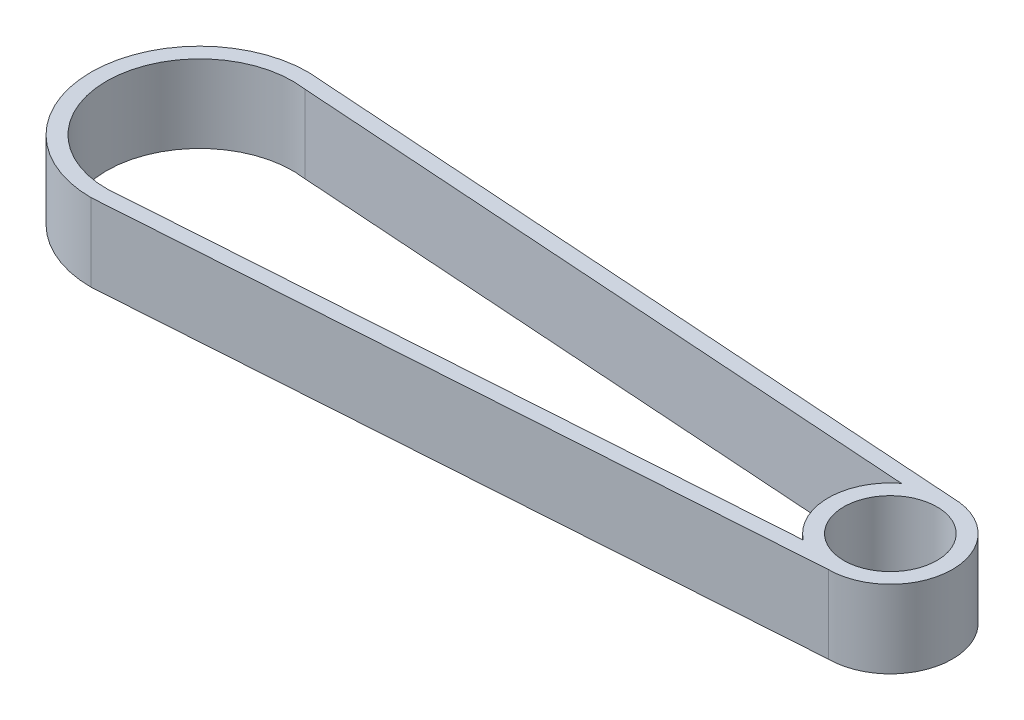
ISO-10303-21;
HEADER;
FILE_DESCRIPTION(('STEP AP214'),'2;1');
FILE_NAME('part.step','',(''),(''),'','','');
FILE_SCHEMA(('AUTOMOTIVE_DESIGN { 1 0 10303 214 1 1 1 1 }'));
ENDSEC;
DATA;
#1=APPLICATION_CONTEXT('core data for automotive mechanical design processes');
#2=APPLICATION_PROTOCOL_DEFINITION('international standard','automotive_design',2000,#1);
#3=PRODUCT_CONTEXT('',#1,'mechanical');
#4=PRODUCT('Part','Part','',(#3));
#5=PRODUCT_RELATED_PRODUCT_CATEGORY('part','',(#4));
#6=PRODUCT_DEFINITION_FORMATION('','',#4);
#7=PRODUCT_DEFINITION_CONTEXT('part definition',#1,'design');
#8=PRODUCT_DEFINITION('design','',#6,#7);
#9=PRODUCT_DEFINITION_SHAPE('','',#8);
#10=(LENGTH_UNIT() NAMED_UNIT(*) SI_UNIT(.MILLI.,.METRE.));
#11=(NAMED_UNIT(*) PLANE_ANGLE_UNIT() SI_UNIT($,.RADIAN.));
#12=(NAMED_UNIT(*) SI_UNIT($,.STERADIAN.) SOLID_ANGLE_UNIT());
#13=UNCERTAINTY_MEASURE_WITH_UNIT(LENGTH_MEASURE(1.E-05),#10,'distance_accuracy_value','');
#14=(GEOMETRIC_REPRESENTATION_CONTEXT(3) GLOBAL_UNCERTAINTY_ASSIGNED_CONTEXT((#13)) GLOBAL_UNIT_ASSIGNED_CONTEXT((#10,
#11,#12)) REPRESENTATION_CONTEXT('',''));
#15=CARTESIAN_POINT('',(0.,0.,0.));
#16=DIRECTION('',(0.,0.,1.));
#17=DIRECTION('',(1.,0.,0.));
#18=AXIS2_PLACEMENT_3D('',#15,#16,#17);
#19=CARTESIAN_POINT('',(0.,10.,0.));
#20=DIRECTION('',(0.,-1.,0.));
#21=DIRECTION('',(0.,0.,-1.));
#22=AXIS2_PLACEMENT_3D('',#19,#20,#21);
#23=CYLINDRICAL_SURFACE('',#22,14.);
#24=CARTESIAN_POINT('',(0.,0.,0.));
#25=DIRECTION('',(0.,1.,0.));
#26=DIRECTION('',(0.,0.,1.));
#27=AXIS2_PLACEMENT_3D('',#24,#25,#26);
#28=CIRCLE('',#27,14.);
#29=CARTESIAN_POINT('',(0.,0.,-14.));
#30=VERTEX_POINT('',#29);
#31=CARTESIAN_POINT('',(0.,0.,14.));
#32=VERTEX_POINT('',#31);
#33=EDGE_CURVE('E151',#30,#32,#28,.T.);
#34=ORIENTED_EDGE('',*,*,#33,.T.);
#35=DIRECTION('',(0.,-1.,0.));
#36=VECTOR('',#35,1.);
#37=CARTESIAN_POINT('',(0.,10.,14.));
#38=LINE('',#37,#36);
#39=CARTESIAN_POINT('',(0.,10.,14.));
#40=VERTEX_POINT('',#39);
#41=EDGE_CURVE('E11',#40,#32,#38,.T.);
#42=ORIENTED_EDGE('',*,*,#41,.F.);
#43=CARTESIAN_POINT('',(0.,10.,0.));
#44=DIRECTION('',(0.,1.,0.));
#45=DIRECTION('',(0.,0.,1.));
#46=AXIS2_PLACEMENT_3D('',#43,#44,#45);
#47=CIRCLE('',#46,14.);
#48=CARTESIAN_POINT('',(0.,10.,-14.));
#49=VERTEX_POINT('',#48);
#50=EDGE_CURVE('E119',#49,#40,#47,.T.);
#51=ORIENTED_EDGE('',*,*,#50,.F.);
#52=DIRECTION('',(0.,-1.,0.));
#53=VECTOR('',#52,1.);
#54=CARTESIAN_POINT('',(0.,10.,-14.));
#55=LINE('',#54,#53);
#56=EDGE_CURVE('E58',#49,#30,#55,.T.);
#57=ORIENTED_EDGE('',*,*,#56,.T.);
#58=EDGE_LOOP('',(#34,#42,#51,#57));
#59=FACE_BOUND('',#58,.T.);
#60=ADVANCED_FACE('F39',(#59),#23,.T.);
#61=CARTESIAN_POINT('',(0.939550081689078,10.,13.9366595450547));
#62=DIRECTION('',(-0.067263052342135,0.,-0.997735276408336));
#63=DIRECTION('',(-0.997735276408336,0.,0.067263052342135));
#64=AXIS2_PLACEMENT_3D('',#61,#62,#63);
#65=PLANE('',#64);
#66=DIRECTION('',(0.997735276408336,0.,-0.067263052342135));
#67=VECTOR('',#66,1.);
#68=CARTESIAN_POINT('',(0.939550081689078,0.,13.9366595450547));
#69=LINE('',#68,#67);
#70=CARTESIAN_POINT('',(89.,0.,8.));
#71=VERTEX_POINT('',#70);
#72=EDGE_CURVE('E125',#32,#71,#69,.T.);
#73=ORIENTED_EDGE('',*,*,#72,.T.);
#74=DIRECTION('',(0.,-1.,0.));
#75=VECTOR('',#74,1.);
#76=CARTESIAN_POINT('',(89.,10.,8.));
#77=LINE('',#76,#75);
#78=CARTESIAN_POINT('',(89.,10.,8.));
#79=VERTEX_POINT('',#78);
#80=EDGE_CURVE('E49',#79,#71,#77,.T.);
#81=ORIENTED_EDGE('',*,*,#80,.F.);
#82=DIRECTION('',(0.997735276408336,0.,-0.067263052342135));
#83=VECTOR('',#82,1.);
#84=CARTESIAN_POINT('',(0.939550081689078,10.,13.9366595450547));
#85=LINE('',#84,#83);
#86=EDGE_CURVE('E113',#40,#79,#85,.T.);
#87=ORIENTED_EDGE('',*,*,#86,.F.);
#88=ORIENTED_EDGE('',*,*,#41,.T.);
#89=EDGE_LOOP('',(#73,#81,#87,#88));
#90=FACE_BOUND('',#89,.T.);
#91=ADVANCED_FACE('F124',(#90),#65,.F.);
#92=CARTESIAN_POINT('',(89.,10.,0.));
#93=DIRECTION('',(0.,-1.,0.));
#94=DIRECTION('',(0.,0.,-1.));
#95=AXIS2_PLACEMENT_3D('',#92,#93,#94);
#96=CYLINDRICAL_SURFACE('',#95,8.);
#97=CARTESIAN_POINT('',(89.,0.,0.));
#98=DIRECTION('',(0.,1.,0.));
#99=DIRECTION('',(0.,0.,1.));
#100=AXIS2_PLACEMENT_3D('',#97,#98,#99);
#101=CIRCLE('',#100,8.);
#102=CARTESIAN_POINT('',(89.,0.,-8.));
#103=VERTEX_POINT('',#102);
#104=EDGE_CURVE('E154',#71,#103,#101,.T.);
#105=ORIENTED_EDGE('',*,*,#104,.T.);
#106=DIRECTION('',(0.,-1.,0.));
#107=VECTOR('',#106,1.);
#108=CARTESIAN_POINT('',(89.,10.,-8.));
#109=LINE('',#108,#107);
#110=CARTESIAN_POINT('',(89.,10.,-8.));
#111=VERTEX_POINT('',#110);
#112=EDGE_CURVE('E85',#111,#103,#109,.T.);
#113=ORIENTED_EDGE('',*,*,#112,.F.);
#114=CARTESIAN_POINT('',(89.,10.,0.));
#115=DIRECTION('',(0.,1.,0.));
#116=DIRECTION('',(0.,0.,1.));
#117=AXIS2_PLACEMENT_3D('',#114,#115,#116);
#118=CIRCLE('',#117,8.);
#119=EDGE_CURVE('E118',#79,#111,#118,.T.);
#120=ORIENTED_EDGE('',*,*,#119,.F.);
#121=ORIENTED_EDGE('',*,*,#80,.T.);
#122=EDGE_LOOP('',(#105,#113,#120,#121));
#123=FACE_BOUND('',#122,.T.);
#124=ADVANCED_FACE('F129',(#123),#96,.T.);
#125=CARTESIAN_POINT('',(0.805023977004808,10.,-11.941188992238));
#126=DIRECTION('',(0.067263052342135,0.,-0.997735276408336));
#127=DIRECTION('',(-0.997735276408336,0.,-0.067263052342135));
#128=AXIS2_PLACEMENT_3D('',#125,#126,#127);
#129=PLANE('',#128);
#130=DIRECTION('',(0.997735276408336,0.,0.067263052342135));
#131=VECTOR('',#130,1.);
#132=CARTESIAN_POINT('',(0.805023977004808,0.,-11.941188992238));
#133=LINE('',#132,#131);
#134=CARTESIAN_POINT('',(1.67479614795493,0.,-11.8825526661065));
#135=VERTEX_POINT('',#134);
#136=CARTESIAN_POINT('',(84.1024141718378,0.,-6.32563459708072));
#137=VERTEX_POINT('',#136);
#138=EDGE_CURVE('E139',#135,#137,#133,.T.);
#139=ORIENTED_EDGE('',*,*,#138,.T.);
#140=DIRECTION('',(0.,-1.,0.));
#141=VECTOR('',#140,1.);
#142=CARTESIAN_POINT('',(84.1024141718378,10.,-6.32563459708072));
#143=LINE('',#142,#141);
#144=CARTESIAN_POINT('',(84.1024141718378,10.,-6.32563459708072));
#145=VERTEX_POINT('',#144);
#146=EDGE_CURVE('E43',#145,#137,#143,.T.);
#147=ORIENTED_EDGE('',*,*,#146,.F.);
#148=DIRECTION('',(0.997735276408336,0.,0.067263052342135));
#149=VECTOR('',#148,1.);
#150=CARTESIAN_POINT('',(0.805023977004808,10.,-11.941188992238));
#151=LINE('',#150,#149);
#152=CARTESIAN_POINT('',(1.67479614795493,10.,-11.8825526661065));
#153=VERTEX_POINT('',#152);
#154=EDGE_CURVE('E215',#153,#145,#151,.T.);
#155=ORIENTED_EDGE('',*,*,#154,.F.);
#156=DIRECTION('',(0.,-1.,0.));
#157=VECTOR('',#156,1.);
#158=CARTESIAN_POINT('',(1.67479614795493,10.,-11.8825526661065));
#159=LINE('',#158,#157);
#160=EDGE_CURVE('E132',#153,#135,#159,.T.);
#161=ORIENTED_EDGE('',*,*,#160,.T.);
#162=EDGE_LOOP('',(#139,#147,#155,#161));
#163=FACE_BOUND('',#162,.T.);
#164=ADVANCED_FACE('F173',(#163),#129,.F.);
#165=CARTESIAN_POINT('',(89.,10.,0.));
#166=DIRECTION('',(0.,-1.,0.));
#167=DIRECTION('',(0.,0.,-1.));
#168=AXIS2_PLACEMENT_3D('',#165,#166,#167);
#169=CYLINDRICAL_SURFACE('',#168,8.);
#170=CARTESIAN_POINT('',(89.,0.,0.));
#171=DIRECTION('',(0.,1.,0.));
#172=DIRECTION('',(0.,0.,1.));
#173=AXIS2_PLACEMENT_3D('',#170,#171,#172);
#174=CIRCLE('',#173,8.);
#175=CARTESIAN_POINT('',(84.1024141718378,0.,6.32563459708072));
#176=VERTEX_POINT('',#175);
#177=EDGE_CURVE('E142',#137,#176,#174,.T.);
#178=ORIENTED_EDGE('',*,*,#177,.T.);
#179=DIRECTION('',(0.,-1.,0.));
#180=VECTOR('',#179,1.);
#181=CARTESIAN_POINT('',(84.1024141718378,10.,6.32563459708072));
#182=LINE('',#181,#180);
#183=CARTESIAN_POINT('',(84.1024141718378,10.,6.32563459708072));
#184=VERTEX_POINT('',#183);
#185=EDGE_CURVE('E164',#184,#176,#182,.T.);
#186=ORIENTED_EDGE('',*,*,#185,.F.);
#187=CARTESIAN_POINT('',(89.,10.,0.));
#188=DIRECTION('',(0.,1.,0.));
#189=DIRECTION('',(0.,0.,1.));
#190=AXIS2_PLACEMENT_3D('',#187,#188,#189);
#191=CIRCLE('',#190,8.);
#192=EDGE_CURVE('E98',#145,#184,#191,.T.);
#193=ORIENTED_EDGE('',*,*,#192,.F.);
#194=ORIENTED_EDGE('',*,*,#146,.T.);
#195=EDGE_LOOP('',(#178,#186,#193,#194));
#196=FACE_BOUND('',#195,.T.);
#197=ADVANCED_FACE('F169',(#196),#169,.T.);
#198=CARTESIAN_POINT('',(0.805023977004809,10.,11.941188992238));
#199=DIRECTION('',(-0.067263052342135,0.,-0.997735276408336));
#200=DIRECTION('',(-0.997735276408336,0.,0.067263052342135));
#201=AXIS2_PLACEMENT_3D('',#198,#199,#200);
#202=PLANE('',#201);
#203=DIRECTION('',(0.997735276408336,0.,-0.067263052342135));
#204=VECTOR('',#203,1.);
#205=CARTESIAN_POINT('',(0.805023977004809,0.,11.941188992238));
#206=LINE('',#205,#204);
#207=CARTESIAN_POINT('',(1.67479614795489,0.,11.8825526661065));
#208=VERTEX_POINT('',#207);
#209=EDGE_CURVE('E145',#208,#176,#206,.T.);
#210=ORIENTED_EDGE('',*,*,#209,.F.);
#211=DIRECTION('',(0.,-1.,0.));
#212=VECTOR('',#211,1.);
#213=CARTESIAN_POINT('',(1.67479614795489,10.,11.8825526661065));
#214=LINE('',#213,#212);
#215=CARTESIAN_POINT('',(1.67479614795489,10.,11.8825526661065));
#216=VERTEX_POINT('',#215);
#217=EDGE_CURVE('E163',#216,#208,#214,.T.);
#218=ORIENTED_EDGE('',*,*,#217,.F.);
#219=DIRECTION('',(0.997735276408336,0.,-0.067263052342135));
#220=VECTOR('',#219,1.);
#221=CARTESIAN_POINT('',(0.805023977004809,10.,11.941188992238));
#222=LINE('',#221,#220);
#223=EDGE_CURVE('E217',#216,#184,#222,.T.);
#224=ORIENTED_EDGE('',*,*,#223,.T.);
#225=ORIENTED_EDGE('',*,*,#185,.T.);
#226=EDGE_LOOP('',(#210,#218,#224,#225));
#227=FACE_BOUND('',#226,.T.);
#228=ADVANCED_FACE('F184',(#227),#202,.T.);
#229=CARTESIAN_POINT('',(0.,10.,0.));
#230=DIRECTION('',(0.,-1.,0.));
#231=DIRECTION('',(0.,0.,-1.));
#232=AXIS2_PLACEMENT_3D('',#229,#230,#231);
#233=CYLINDRICAL_SURFACE('',#232,12.);
#234=CARTESIAN_POINT('',(0.,0.,0.));
#235=DIRECTION('',(0.,1.,0.));
#236=DIRECTION('',(0.,0.,1.));
#237=AXIS2_PLACEMENT_3D('',#234,#235,#236);
#238=CIRCLE('',#237,12.);
#239=EDGE_CURVE('E148',#135,#208,#238,.T.);
#240=ORIENTED_EDGE('',*,*,#239,.F.);
#241=ORIENTED_EDGE('',*,*,#160,.F.);
#242=CARTESIAN_POINT('',(0.,10.,0.));
#243=DIRECTION('',(0.,1.,0.));
#244=DIRECTION('',(0.,0.,1.));
#245=AXIS2_PLACEMENT_3D('',#242,#243,#244);
#246=CIRCLE('',#245,12.);
#247=EDGE_CURVE('E182',#153,#216,#246,.T.);
#248=ORIENTED_EDGE('',*,*,#247,.T.);
#249=ORIENTED_EDGE('',*,*,#217,.T.);
#250=EDGE_LOOP('',(#240,#241,#248,#249));
#251=FACE_BOUND('',#250,.T.);
#252=ADVANCED_FACE('F179',(#251),#233,.F.);
#253=CARTESIAN_POINT('',(89.,10.,0.));
#254=DIRECTION('',(0.,-1.,0.));
#255=DIRECTION('',(0.,0.,-1.));
#256=AXIS2_PLACEMENT_3D('',#253,#254,#255);
#257=CYLINDRICAL_SURFACE('',#256,5.99999999999999);
#258=CARTESIAN_POINT('',(89.,10.,0.));
#259=DIRECTION('',(0.,1.,0.));
#260=DIRECTION('',(0.,0.,1.));
#261=AXIS2_PLACEMENT_3D('',#258,#259,#260);
#262=CIRCLE('',#261,5.99999999999999);
#263=CARTESIAN_POINT('',(89.,10.,5.99999999999999));
#264=VERTEX_POINT('',#263);
#265=EDGE_CURVE('E159',#264,#264,#262,.T.);
#266=ORIENTED_EDGE('',*,*,#265,.T.);
#267=EDGE_LOOP('',(#266));
#268=FACE_BOUND('',#267,.T.);
#269=CARTESIAN_POINT('',(89.,0.,0.));
#270=DIRECTION('',(0.,1.,0.));
#271=DIRECTION('',(0.,0.,1.));
#272=AXIS2_PLACEMENT_3D('',#269,#270,#271);
#273=CIRCLE('',#272,5.99999999999999);
#274=CARTESIAN_POINT('',(89.,0.,5.99999999999999));
#275=VERTEX_POINT('',#274);
#276=EDGE_CURVE('E136',#275,#275,#273,.T.);
#277=ORIENTED_EDGE('',*,*,#276,.F.);
#278=EDGE_LOOP('',(#277));
#279=FACE_BOUND('',#278,.T.);
#280=ADVANCED_FACE('F41',(#268,#279),#257,.F.);
#281=CARTESIAN_POINT('',(0.939550081689078,10.,-13.9366595450547));
#282=DIRECTION('',(0.067263052342135,0.,-0.997735276408336));
#283=DIRECTION('',(-0.997735276408336,0.,-0.067263052342135));
#284=AXIS2_PLACEMENT_3D('',#281,#282,#283);
#285=PLANE('',#284);
#286=DIRECTION('',(0.997735276408336,0.,0.067263052342135));
#287=VECTOR('',#286,1.);
#288=CARTESIAN_POINT('',(0.939550081689078,0.,-13.9366595450547));
#289=LINE('',#288,#287);
#290=EDGE_CURVE('E156',#30,#103,#289,.T.);
#291=ORIENTED_EDGE('',*,*,#290,.F.);
#292=ORIENTED_EDGE('',*,*,#56,.F.);
#293=DIRECTION('',(0.997735276408336,0.,0.067263052342135));
#294=VECTOR('',#293,1.);
#295=CARTESIAN_POINT('',(0.939550081689078,10.,-13.9366595450547));
#296=LINE('',#295,#294);
#297=EDGE_CURVE('E130',#49,#111,#296,.T.);
#298=ORIENTED_EDGE('',*,*,#297,.T.);
#299=ORIENTED_EDGE('',*,*,#112,.T.);
#300=EDGE_LOOP('',(#291,#292,#298,#299));
#301=FACE_BOUND('',#300,.T.);
#302=ADVANCED_FACE('F202',(#301),#285,.T.);
#303=CARTESIAN_POINT('',(0.,10.,0.));
#304=DIRECTION('',(0.,1.,0.));
#305=DIRECTION('',(0.,0.,1.));
#306=AXIS2_PLACEMENT_3D('',#303,#304,#305);
#307=PLANE('',#306);
#308=ORIENTED_EDGE('',*,*,#265,.F.);
#309=EDGE_LOOP('',(#308));
#310=FACE_BOUND('',#309,.T.);
#311=ORIENTED_EDGE('',*,*,#154,.T.);
#312=ORIENTED_EDGE('',*,*,#192,.T.);
#313=ORIENTED_EDGE('',*,*,#223,.F.);
#314=ORIENTED_EDGE('',*,*,#247,.F.);
#315=EDGE_LOOP('',(#311,#312,#313,#314));
#316=FACE_BOUND('',#315,.T.);
#317=ORIENTED_EDGE('',*,*,#50,.T.);
#318=ORIENTED_EDGE('',*,*,#86,.T.);
#319=ORIENTED_EDGE('',*,*,#119,.T.);
#320=ORIENTED_EDGE('',*,*,#297,.F.);
#321=EDGE_LOOP('',(#317,#318,#319,#320));
#322=FACE_BOUND('',#321,.T.);
#323=ADVANCED_FACE('F115',(#310,#316,#322),#307,.T.);
#324=CARTESIAN_POINT('',(0.,0.,0.));
#325=DIRECTION('',(0.,1.,0.));
#326=DIRECTION('',(0.,0.,1.));
#327=AXIS2_PLACEMENT_3D('',#324,#325,#326);
#328=PLANE('',#327);
#329=ORIENTED_EDGE('',*,*,#276,.T.);
#330=EDGE_LOOP('',(#329));
#331=FACE_BOUND('',#330,.T.);
#332=ORIENTED_EDGE('',*,*,#138,.F.);
#333=ORIENTED_EDGE('',*,*,#239,.T.);
#334=ORIENTED_EDGE('',*,*,#209,.T.);
#335=ORIENTED_EDGE('',*,*,#177,.F.);
#336=EDGE_LOOP('',(#332,#333,#334,#335));
#337=FACE_BOUND('',#336,.T.);
#338=ORIENTED_EDGE('',*,*,#33,.F.);
#339=ORIENTED_EDGE('',*,*,#290,.T.);
#340=ORIENTED_EDGE('',*,*,#104,.F.);
#341=ORIENTED_EDGE('',*,*,#72,.F.);
#342=EDGE_LOOP('',(#338,#339,#340,#341));
#343=FACE_BOUND('',#342,.T.);
#344=ADVANCED_FACE('F176',(#331,#337,#343),#328,.F.);
#345=CLOSED_SHELL('',(#60,#91,#124,#164,#197,#228,#252,#280,#302,#323,#344));
#346=MANIFOLD_SOLID_BREP('B2',#345);
#347=ADVANCED_BREP_SHAPE_REPRESENTATION('',(#18,#346),#14);
#348=SHAPE_DEFINITION_REPRESENTATION(#9,#347);
ENDSEC;
END-ISO-10303-21;
